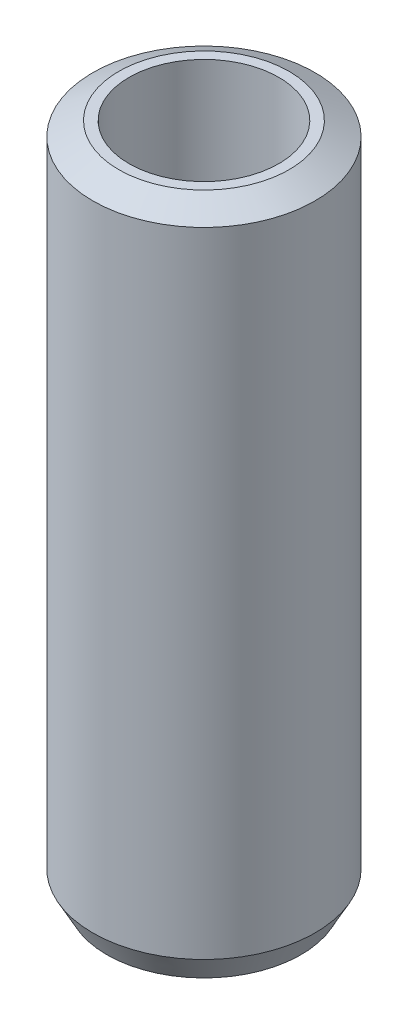
ISO-10303-21;
HEADER;
FILE_DESCRIPTION(('STEP AP214'),'2;1');
FILE_NAME('part.step','',(''),(''),'','','');
FILE_SCHEMA(('AUTOMOTIVE_DESIGN { 1 0 10303 214 1 1 1 1 }'));
ENDSEC;
DATA;
#1=APPLICATION_CONTEXT('core data for automotive mechanical design processes');
#2=APPLICATION_PROTOCOL_DEFINITION('international standard','automotive_design',2000,#1);
#3=PRODUCT_CONTEXT('',#1,'mechanical');
#4=PRODUCT('Part','Part','',(#3));
#5=PRODUCT_RELATED_PRODUCT_CATEGORY('part','',(#4));
#6=PRODUCT_DEFINITION_FORMATION('','',#4);
#7=PRODUCT_DEFINITION_CONTEXT('part definition',#1,'design');
#8=PRODUCT_DEFINITION('design','',#6,#7);
#9=PRODUCT_DEFINITION_SHAPE('','',#8);
#10=(LENGTH_UNIT() NAMED_UNIT(*) SI_UNIT(.MILLI.,.METRE.));
#11=(NAMED_UNIT(*) PLANE_ANGLE_UNIT() SI_UNIT($,.RADIAN.));
#12=(NAMED_UNIT(*) SI_UNIT($,.STERADIAN.) SOLID_ANGLE_UNIT());
#13=UNCERTAINTY_MEASURE_WITH_UNIT(LENGTH_MEASURE(1.E-05),#10,'distance_accuracy_value','');
#14=(GEOMETRIC_REPRESENTATION_CONTEXT(3) GLOBAL_UNCERTAINTY_ASSIGNED_CONTEXT((#13)) GLOBAL_UNIT_ASSIGNED_CONTEXT((#10,
#11,#12)) REPRESENTATION_CONTEXT('',''));
#15=CARTESIAN_POINT('',(0.,0.,0.));
#16=DIRECTION('',(0.,0.,1.));
#17=DIRECTION('',(1.,0.,0.));
#18=AXIS2_PLACEMENT_3D('',#15,#16,#17);
#19=CARTESIAN_POINT('',(0.,106.129228183129,0.));
#20=DIRECTION('',(0.,-1.,0.));
#21=DIRECTION('',(0.,0.,-1.));
#22=AXIS2_PLACEMENT_3D('',#19,#20,#21);
#23=CYLINDRICAL_SURFACE('',#22,17.5);
#24=CARTESIAN_POINT('',(0.,103.917773037331,0.));
#25=DIRECTION('',(0.,1.,0.));
#26=DIRECTION('',(0.,0.,1.));
#27=AXIS2_PLACEMENT_3D('',#24,#25,#26);
#28=CIRCLE('',#27,17.5);
#29=CARTESIAN_POINT('',(0.,103.917773037331,17.5));
#30=VERTEX_POINT('',#29);
#31=EDGE_CURVE('E50',#30,#30,#28,.F.);
#32=ORIENTED_EDGE('',*,*,#31,.T.);
#33=EDGE_LOOP('',(#32));
#34=FACE_BOUND('',#33,.T.);
#35=CARTESIAN_POINT('',(0.,4.08480883359633,0.));
#36=DIRECTION('',(0.,1.,0.));
#37=DIRECTION('',(0.,0.,1.));
#38=AXIS2_PLACEMENT_3D('',#35,#36,#37);
#39=CIRCLE('',#38,17.5);
#40=CARTESIAN_POINT('',(0.,4.08480883359633,17.5));
#41=VERTEX_POINT('',#40);
#42=EDGE_CURVE('E51',#41,#41,#39,.T.);
#43=ORIENTED_EDGE('',*,*,#42,.T.);
#44=EDGE_LOOP('',(#43));
#45=FACE_BOUND('',#44,.T.);
#46=ADVANCED_FACE('F39',(#34,#45),#23,.T.);
#47=CARTESIAN_POINT('',(0.,106.129228183129,0.));
#48=DIRECTION('',(0.,1.,0.));
#49=DIRECTION('',(0.,0.,1.));
#50=AXIS2_PLACEMENT_3D('',#47,#48,#49);
#51=PLANE('',#50);
#52=CARTESIAN_POINT('',(0.,106.129228183129,0.));
#53=DIRECTION('',(0.,1.,0.));
#54=DIRECTION('',(0.,0.,1.));
#55=AXIS2_PLACEMENT_3D('',#52,#53,#54);
#56=CIRCLE('',#55,13.4151911664037);
#57=CARTESIAN_POINT('',(0.,106.129228183129,13.4151911664037));
#58=VERTEX_POINT('',#57);
#59=EDGE_CURVE('E54',#58,#58,#56,.T.);
#60=ORIENTED_EDGE('',*,*,#59,.T.);
#61=EDGE_LOOP('',(#60));
#62=FACE_BOUND('',#61,.T.);
#63=CARTESIAN_POINT('',(0.,106.129228183129,0.));
#64=DIRECTION('',(0.,1.,0.));
#65=DIRECTION('',(0.,0.,1.));
#66=AXIS2_PLACEMENT_3D('',#63,#64,#65);
#67=CIRCLE('',#66,11.7903692274262);
#68=CARTESIAN_POINT('',(0.,106.129228183129,11.7903692274262));
#69=VERTEX_POINT('',#68);
#70=EDGE_CURVE('E58',#69,#69,#67,.T.);
#71=ORIENTED_EDGE('',*,*,#70,.F.);
#72=EDGE_LOOP('',(#71));
#73=FACE_BOUND('',#72,.T.);
#74=ADVANCED_FACE('F69',(#62,#73),#51,.T.);
#75=CARTESIAN_POINT('',(0.,0.,0.));
#76=DIRECTION('',(0.,1.,0.));
#77=DIRECTION('',(0.,0.,1.));
#78=AXIS2_PLACEMENT_3D('',#75,#76,#77);
#79=PLANE('',#78);
#80=CARTESIAN_POINT('',(0.,0.,0.));
#81=DIRECTION('',(0.,1.,0.));
#82=DIRECTION('',(0.,0.,1.));
#83=AXIS2_PLACEMENT_3D('',#80,#81,#82);
#84=CIRCLE('',#83,15.2885448542025);
#85=CARTESIAN_POINT('',(0.,0.,15.2885448542025));
#86=VERTEX_POINT('',#85);
#87=EDGE_CURVE('E10',#86,#86,#84,.F.);
#88=ORIENTED_EDGE('',*,*,#87,.T.);
#89=EDGE_LOOP('',(#88));
#90=FACE_BOUND('',#89,.T.);
#91=CARTESIAN_POINT('',(0.,0.,0.));
#92=DIRECTION('',(0.,1.,0.));
#93=DIRECTION('',(0.,0.,1.));
#94=AXIS2_PLACEMENT_3D('',#91,#92,#93);
#95=CIRCLE('',#94,11.7903692274262);
#96=CARTESIAN_POINT('',(0.,0.,11.7903692274262));
#97=VERTEX_POINT('',#96);
#98=EDGE_CURVE('E63',#97,#97,#95,.T.);
#99=ORIENTED_EDGE('',*,*,#98,.T.);
#100=EDGE_LOOP('',(#99));
#101=FACE_BOUND('',#100,.T.);
#102=ADVANCED_FACE('F75',(#90,#101),#79,.F.);
#103=CARTESIAN_POINT('',(0.,106.129228183129,0.));
#104=DIRECTION('',(0.,-1.,0.));
#105=DIRECTION('',(0.,0.,-1.));
#106=AXIS2_PLACEMENT_3D('',#103,#104,#105);
#107=CYLINDRICAL_SURFACE('',#106,11.7903692274262);
#108=ORIENTED_EDGE('',*,*,#70,.T.);
#109=EDGE_LOOP('',(#108));
#110=FACE_BOUND('',#109,.T.);
#111=ORIENTED_EDGE('',*,*,#98,.F.);
#112=EDGE_LOOP('',(#111));
#113=FACE_BOUND('',#112,.T.);
#114=ADVANCED_FACE('F70',(#110,#113),#107,.F.);
#115=CARTESIAN_POINT('',(0.,106.129228183129,0.));
#116=DIRECTION('',(0.,-1.,0.));
#117=DIRECTION('',(0.,0.,-1.));
#118=AXIS2_PLACEMENT_3D('',#115,#116,#117);
#119=CONICAL_SURFACE('',#118,13.4151911664037,1.07459119758234);
#120=ORIENTED_EDGE('',*,*,#31,.F.);
#121=EDGE_LOOP('',(#120));
#122=FACE_BOUND('',#121,.T.);
#123=ORIENTED_EDGE('',*,*,#59,.F.);
#124=EDGE_LOOP('',(#123));
#125=FACE_BOUND('',#124,.T.);
#126=ADVANCED_FACE('F81',(#122,#125),#119,.T.);
#127=CARTESIAN_POINT('',(0.,4.08480883359633,0.));
#128=DIRECTION('',(0.,1.,0.));
#129=DIRECTION('',(0.,0.,1.));
#130=AXIS2_PLACEMENT_3D('',#127,#128,#129);
#131=CONICAL_SURFACE('',#130,17.5,0.496205129212555);
#132=ORIENTED_EDGE('',*,*,#87,.F.);
#133=EDGE_LOOP('',(#132));
#134=FACE_BOUND('',#133,.T.);
#135=ORIENTED_EDGE('',*,*,#42,.F.);
#136=EDGE_LOOP('',(#135));
#137=FACE_BOUND('',#136,.T.);
#138=ADVANCED_FACE('F45',(#134,#137),#131,.T.);
#139=CLOSED_SHELL('',(#46,#74,#102,#114,#126,#138));
#140=MANIFOLD_SOLID_BREP('B2',#139);
#141=ADVANCED_BREP_SHAPE_REPRESENTATION('',(#18,#140),#14);
#142=SHAPE_DEFINITION_REPRESENTATION(#9,#141);
ENDSEC;
END-ISO-10303-21;
